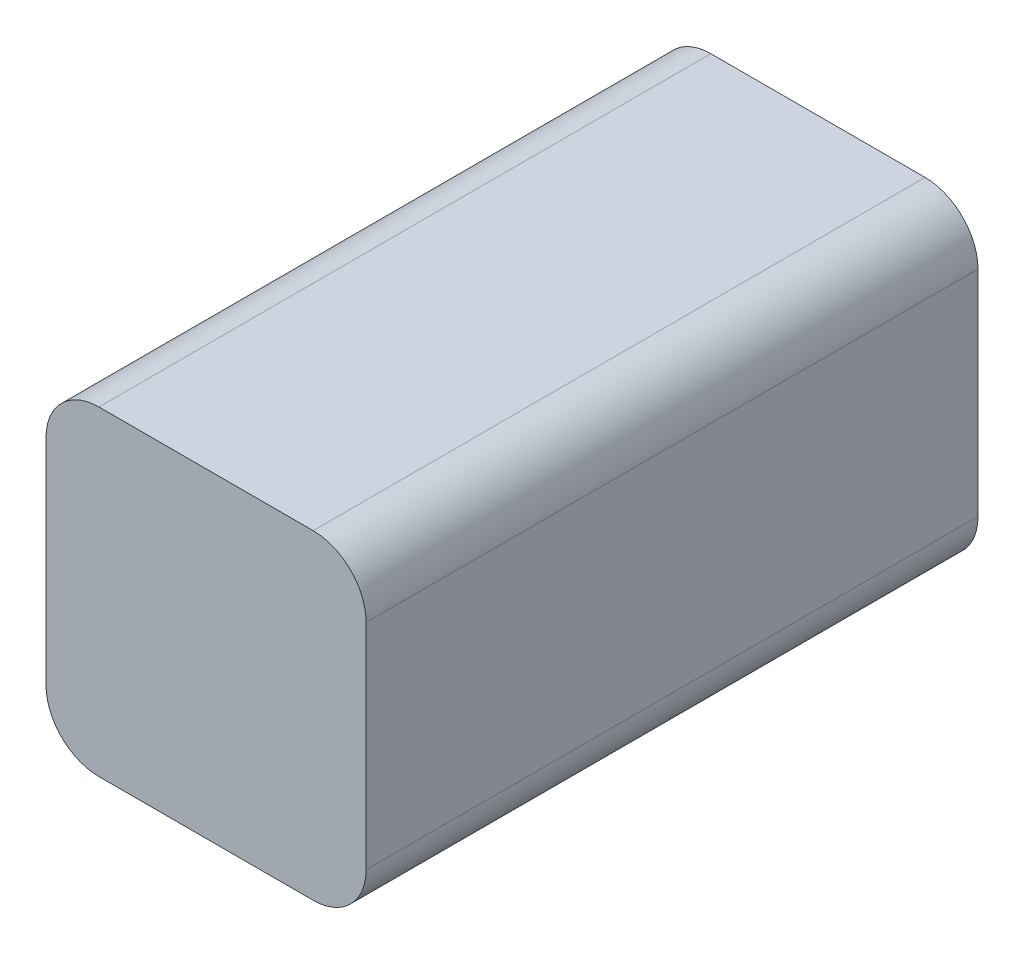
ISO-10303-21;
HEADER;
FILE_DESCRIPTION(('STEP AP214'),'2;1');
FILE_NAME('part.step','',(''),(''),'','','');
FILE_SCHEMA(('AUTOMOTIVE_DESIGN { 1 0 10303 214 1 1 1 1 }'));
ENDSEC;
DATA;
#1=APPLICATION_CONTEXT('core data for automotive mechanical design processes');
#2=APPLICATION_PROTOCOL_DEFINITION('international standard','automotive_design',2000,#1);
#3=PRODUCT_CONTEXT('',#1,'mechanical');
#4=PRODUCT('Part','Part','',(#3));
#5=PRODUCT_RELATED_PRODUCT_CATEGORY('part','',(#4));
#6=PRODUCT_DEFINITION_FORMATION('','',#4);
#7=PRODUCT_DEFINITION_CONTEXT('part definition',#1,'design');
#8=PRODUCT_DEFINITION('design','',#6,#7);
#9=PRODUCT_DEFINITION_SHAPE('','',#8);
#10=(LENGTH_UNIT() NAMED_UNIT(*) SI_UNIT(.MILLI.,.METRE.));
#11=(NAMED_UNIT(*) PLANE_ANGLE_UNIT() SI_UNIT($,.RADIAN.));
#12=(NAMED_UNIT(*) SI_UNIT($,.STERADIAN.) SOLID_ANGLE_UNIT());
#13=UNCERTAINTY_MEASURE_WITH_UNIT(LENGTH_MEASURE(1.E-05),#10,'distance_accuracy_value','');
#14=(GEOMETRIC_REPRESENTATION_CONTEXT(3) GLOBAL_UNCERTAINTY_ASSIGNED_CONTEXT((#13)) GLOBAL_UNIT_ASSIGNED_CONTEXT((#10,
#11,#12)) REPRESENTATION_CONTEXT('',''));
#15=CARTESIAN_POINT('',(0.,0.,0.));
#16=DIRECTION('',(0.,0.,1.));
#17=DIRECTION('',(1.,0.,0.));
#18=AXIS2_PLACEMENT_3D('',#15,#16,#17);
#19=CARTESIAN_POINT('',(15.2000000000698,15.2000000000203,-15.));
#20=DIRECTION('',(1.,-2.57698983679999E-12,0.));
#21=DIRECTION('',(2.57698983679999E-12,1.,0.));
#22=AXIS2_PLACEMENT_3D('',#19,#20,#21);
#23=PLANE('',#22);
#24=DIRECTION('',(-2.57698983679999E-12,-1.,0.));
#25=VECTOR('',#24,1.);
#26=CARTESIAN_POINT('',(15.2000000000698,15.2000000000203,-15.));
#27=LINE('',#26,#25);
#28=CARTESIAN_POINT('',(15.2000000000616,12.0250000000204,-15.));
#29=VERTEX_POINT('',#28);
#30=CARTESIAN_POINT('',(15.2000000000285,-0.825000000020372,-15.));
#31=VERTEX_POINT('',#30);
#32=EDGE_CURVE('E182',#29,#31,#27,.T.);
#33=ORIENTED_EDGE('',*,*,#32,.F.);
#34=DIRECTION('',(0.,0.,1.));
#35=VECTOR('',#34,1.);
#36=CARTESIAN_POINT('',(15.2000000000616,12.0250000000204,21.7));
#37=LINE('',#36,#35);
#38=CARTESIAN_POINT('',(15.2000000000616,12.0250000000204,21.7));
#39=VERTEX_POINT('',#38);
#40=EDGE_CURVE('E194',#29,#39,#37,.T.);
#41=ORIENTED_EDGE('',*,*,#40,.T.);
#42=DIRECTION('',(-2.57698983679999E-12,-1.,0.));
#43=VECTOR('',#42,1.);
#44=CARTESIAN_POINT('',(15.2000000000698,15.2000000000203,21.7));
#45=LINE('',#44,#43);
#46=CARTESIAN_POINT('',(15.2000000000285,-0.825000000020372,21.7));
#47=VERTEX_POINT('',#46);
#48=EDGE_CURVE('E177',#39,#47,#45,.T.);
#49=ORIENTED_EDGE('',*,*,#48,.T.);
#50=DIRECTION('',(0.,0.,1.));
#51=VECTOR('',#50,1.);
#52=CARTESIAN_POINT('',(15.2000000000285,-0.825000000020372,-15.));
#53=LINE('',#52,#51);
#54=EDGE_CURVE('E185',#47,#31,#53,.F.);
#55=ORIENTED_EDGE('',*,*,#54,.T.);
#56=EDGE_LOOP('',(#33,#41,#49,#55));
#57=FACE_BOUND('',#56,.T.);
#58=ADVANCED_FACE('F37',(#57),#23,.T.);
#59=CARTESIAN_POINT('',(-3.99999999992142,15.2000000000698,-15.));
#60=DIRECTION('',(0.,0.,-1.));
#61=DIRECTION('',(-1.,0.,0.));
#62=AXIS2_PLACEMENT_3D('',#59,#60,#61);
#63=PLANE('',#62);
#64=DIRECTION('',(0.,-1.,0.));
#65=VECTOR('',#64,1.);
#66=CARTESIAN_POINT('',(11.5,11.5,-15.));
#67=LINE('',#66,#65);
#68=CARTESIAN_POINT('',(11.5,11.5,-15.));
#69=VERTEX_POINT('',#68);
#70=CARTESIAN_POINT('',(11.5,-0.3,-15.));
#71=VERTEX_POINT('',#70);
#72=EDGE_CURVE('E134',#69,#71,#67,.T.);
#73=ORIENTED_EDGE('',*,*,#72,.F.);
#74=DIRECTION('',(1.,0.,0.));
#75=VECTOR('',#74,1.);
#76=CARTESIAN_POINT('',(-0.3,11.5,-15.));
#77=LINE('',#76,#75);
#78=CARTESIAN_POINT('',(-0.3,11.5,-15.));
#79=VERTEX_POINT('',#78);
#80=EDGE_CURVE('E151',#79,#69,#77,.T.);
#81=ORIENTED_EDGE('',*,*,#80,.F.);
#82=DIRECTION('',(0.,1.,0.));
#83=VECTOR('',#82,1.);
#84=CARTESIAN_POINT('',(-0.3,-0.3,-15.));
#85=LINE('',#84,#83);
#86=CARTESIAN_POINT('',(-0.3,-0.3,-15.));
#87=VERTEX_POINT('',#86);
#88=EDGE_CURVE('E154',#87,#79,#85,.T.);
#89=ORIENTED_EDGE('',*,*,#88,.F.);
#90=DIRECTION('',(-1.,0.,0.));
#91=VECTOR('',#90,1.);
#92=CARTESIAN_POINT('',(11.5,-0.3,-15.));
#93=LINE('',#92,#91);
#94=EDGE_CURVE('E160',#71,#87,#93,.T.);
#95=ORIENTED_EDGE('',*,*,#94,.F.);
#96=EDGE_LOOP('',(#73,#81,#89,#95));
#97=FACE_BOUND('',#96,.T.);
#98=DIRECTION('',(1.,-2.57696786363714E-12,0.));
#99=VECTOR('',#98,1.);
#100=CARTESIAN_POINT('',(-3.99999999992142,15.2000000000698,-15.));
#101=LINE('',#100,#99);
#102=CARTESIAN_POINT('',(-0.824999999921419,15.2000000000616,-15.));
#103=VERTEX_POINT('',#102);
#104=CARTESIAN_POINT('',(12.0250000000698,15.2000000000285,-15.));
#105=VERTEX_POINT('',#104);
#106=EDGE_CURVE('E173',#103,#105,#101,.T.);
#107=ORIENTED_EDGE('',*,*,#106,.T.);
#108=CARTESIAN_POINT('',(12.0250000000616,12.0250000000285,-15.));
#109=DIRECTION('',(0.,0.,-1.));
#110=DIRECTION('',(-1.,0.,0.));
#111=AXIS2_PLACEMENT_3D('',#108,#109,#110);
#112=CIRCLE('',#111,3.175);
#113=EDGE_CURVE('E213',#105,#29,#112,.T.);
#114=ORIENTED_EDGE('',*,*,#113,.T.);
#115=ORIENTED_EDGE('',*,*,#32,.T.);
#116=CARTESIAN_POINT('',(12.0250000000285,-0.825000000012191,-15.));
#117=DIRECTION('',(0.,0.,-1.));
#118=DIRECTION('',(-1.,0.,0.));
#119=AXIS2_PLACEMENT_3D('',#116,#117,#118);
#120=CIRCLE('',#119,3.175);
#121=CARTESIAN_POINT('',(12.0250000000204,-4.00000000001219,-15.));
#122=VERTEX_POINT('',#121);
#123=EDGE_CURVE('E211',#31,#122,#120,.T.);
#124=ORIENTED_EDGE('',*,*,#123,.T.);
#125=DIRECTION('',(1.,-2.57696786363714E-12,0.));
#126=VECTOR('',#125,1.);
#127=CARTESIAN_POINT('',(-3.9999999999709,-3.99999999997089,-15.));
#128=LINE('',#127,#126);
#129=CARTESIAN_POINT('',(-0.824999999970898,-3.99999999997908,-15.));
#130=VERTEX_POINT('',#129);
#131=EDGE_CURVE('E174',#130,#122,#128,.T.);
#132=ORIENTED_EDGE('',*,*,#131,.F.);
#133=CARTESIAN_POINT('',(-0.824999999962716,-0.824999999979077,-15.));
#134=DIRECTION('',(0.,0.,-1.));
#135=DIRECTION('',(-1.,0.,0.));
#136=AXIS2_PLACEMENT_3D('',#133,#134,#135);
#137=CIRCLE('',#136,3.175);
#138=CARTESIAN_POINT('',(-3.99999999996271,-0.824999999970894,-15.));
#139=VERTEX_POINT('',#138);
#140=EDGE_CURVE('E52',#130,#139,#137,.T.);
#141=ORIENTED_EDGE('',*,*,#140,.T.);
#142=DIRECTION('',(-2.57698983679999E-12,-1.,0.));
#143=VECTOR('',#142,1.);
#144=CARTESIAN_POINT('',(-3.99999999992142,15.2000000000698,-15.));
#145=LINE('',#144,#143);
#146=CARTESIAN_POINT('',(-3.9999999999296,12.0250000000698,-15.));
#147=VERTEX_POINT('',#146);
#148=EDGE_CURVE('E186',#147,#139,#145,.T.);
#149=ORIENTED_EDGE('',*,*,#148,.F.);
#150=CARTESIAN_POINT('',(-0.824999999929601,12.0250000000616,-15.));
#151=DIRECTION('',(0.,0.,-1.));
#152=DIRECTION('',(-1.,0.,0.));
#153=AXIS2_PLACEMENT_3D('',#150,#151,#152);
#154=CIRCLE('',#153,3.175);
#155=EDGE_CURVE('E60',#147,#103,#154,.T.);
#156=ORIENTED_EDGE('',*,*,#155,.T.);
#157=EDGE_LOOP('',(#107,#114,#115,#124,#132,#141,#149,#156));
#158=FACE_BOUND('',#157,.T.);
#159=ADVANCED_FACE('F235',(#97,#158),#63,.T.);
#160=CARTESIAN_POINT('',(-3.99999999992142,15.2000000000698,21.7));
#161=DIRECTION('',(-1.,2.57698983679999E-12,0.));
#162=DIRECTION('',(-2.57698983679999E-12,-1.,0.));
#163=AXIS2_PLACEMENT_3D('',#160,#161,#162);
#164=PLANE('',#163);
#165=DIRECTION('',(-2.57698983679999E-12,-1.,0.));
#166=VECTOR('',#165,1.);
#167=CARTESIAN_POINT('',(-3.99999999992142,15.2000000000698,21.7));
#168=LINE('',#167,#166);
#169=CARTESIAN_POINT('',(-3.9999999999296,12.0250000000698,21.7));
#170=VERTEX_POINT('',#169);
#171=CARTESIAN_POINT('',(-3.99999999996272,-0.824999999970894,21.7));
#172=VERTEX_POINT('',#171);
#173=EDGE_CURVE('E188',#170,#172,#168,.T.);
#174=ORIENTED_EDGE('',*,*,#173,.F.);
#175=DIRECTION('',(0.,0.,-1.));
#176=VECTOR('',#175,1.);
#177=CARTESIAN_POINT('',(-3.9999999999296,12.0250000000698,-15.));
#178=LINE('',#177,#176);
#179=EDGE_CURVE('E11',#170,#147,#178,.T.);
#180=ORIENTED_EDGE('',*,*,#179,.T.);
#181=ORIENTED_EDGE('',*,*,#148,.T.);
#182=DIRECTION('',(0.,0.,-1.));
#183=VECTOR('',#182,1.);
#184=CARTESIAN_POINT('',(-3.99999999996272,-0.824999999970894,21.7));
#185=LINE('',#184,#183);
#186=EDGE_CURVE('E45',#139,#172,#185,.F.);
#187=ORIENTED_EDGE('',*,*,#186,.T.);
#188=EDGE_LOOP('',(#174,#180,#181,#187));
#189=FACE_BOUND('',#188,.T.);
#190=ADVANCED_FACE('F223',(#189),#164,.T.);
#191=CARTESIAN_POINT('',(15.2000000000698,15.2000000000203,21.7));
#192=DIRECTION('',(0.,0.,1.));
#193=DIRECTION('',(1.,0.,0.));
#194=AXIS2_PLACEMENT_3D('',#191,#192,#193);
#195=PLANE('',#194);
#196=ORIENTED_EDGE('',*,*,#48,.F.);
#197=CARTESIAN_POINT('',(12.0250000000616,12.0250000000285,21.7));
#198=DIRECTION('',(0.,0.,1.));
#199=DIRECTION('',(1.,0.,0.));
#200=AXIS2_PLACEMENT_3D('',#197,#198,#199);
#201=CIRCLE('',#200,3.175);
#202=CARTESIAN_POINT('',(12.0250000000698,15.2000000000285,21.7));
#203=VERTEX_POINT('',#202);
#204=EDGE_CURVE('E203',#39,#203,#201,.T.);
#205=ORIENTED_EDGE('',*,*,#204,.T.);
#206=DIRECTION('',(-1.,2.57696786363714E-12,0.));
#207=VECTOR('',#206,1.);
#208=CARTESIAN_POINT('',(15.2000000000698,15.2000000000203,21.7));
#209=LINE('',#208,#207);
#210=CARTESIAN_POINT('',(-0.82499999992142,15.2000000000616,21.7));
#211=VERTEX_POINT('',#210);
#212=EDGE_CURVE('E170',#203,#211,#209,.T.);
#213=ORIENTED_EDGE('',*,*,#212,.T.);
#214=CARTESIAN_POINT('',(-0.824999999929603,12.0250000000616,21.7));
#215=DIRECTION('',(0.,0.,1.));
#216=DIRECTION('',(1.,0.,0.));
#217=AXIS2_PLACEMENT_3D('',#214,#215,#216);
#218=CIRCLE('',#217,3.175);
#219=EDGE_CURVE('E199',#211,#170,#218,.T.);
#220=ORIENTED_EDGE('',*,*,#219,.T.);
#221=ORIENTED_EDGE('',*,*,#173,.T.);
#222=CARTESIAN_POINT('',(-0.824999999962717,-0.824999999979077,21.7));
#223=DIRECTION('',(0.,0.,1.));
#224=DIRECTION('',(1.,0.,0.));
#225=AXIS2_PLACEMENT_3D('',#222,#223,#224);
#226=CIRCLE('',#225,3.175);
#227=CARTESIAN_POINT('',(-0.824999999970898,-3.99999999997908,21.7));
#228=VERTEX_POINT('',#227);
#229=EDGE_CURVE('E197',#172,#228,#226,.T.);
#230=ORIENTED_EDGE('',*,*,#229,.T.);
#231=DIRECTION('',(-1.,2.57696786363714E-12,0.));
#232=VECTOR('',#231,1.);
#233=CARTESIAN_POINT('',(15.2000000000203,-4.00000000002037,21.7));
#234=LINE('',#233,#232);
#235=CARTESIAN_POINT('',(12.0250000000203,-4.00000000001219,21.7));
#236=VERTEX_POINT('',#235);
#237=EDGE_CURVE('E166',#236,#228,#234,.T.);
#238=ORIENTED_EDGE('',*,*,#237,.F.);
#239=CARTESIAN_POINT('',(12.0250000000285,-0.825000000012191,21.7));
#240=DIRECTION('',(0.,0.,1.));
#241=DIRECTION('',(1.,0.,0.));
#242=AXIS2_PLACEMENT_3D('',#239,#240,#241);
#243=CIRCLE('',#242,3.175);
#244=EDGE_CURVE('E201',#236,#47,#243,.T.);
#245=ORIENTED_EDGE('',*,*,#244,.T.);
#246=EDGE_LOOP('',(#196,#205,#213,#220,#221,#230,#238,#245));
#247=FACE_BOUND('',#246,.T.);
#248=ADVANCED_FACE('F228',(#247),#195,.T.);
#249=CARTESIAN_POINT('',(3.91703334121647E-11,15.2000000000595,0.));
#250=DIRECTION('',(-2.57696786363714E-12,-1.,0.));
#251=DIRECTION('',(1.,-2.57696786363714E-12,0.));
#252=AXIS2_PLACEMENT_3D('',#249,#250,#251);
#253=PLANE('',#252);
#254=ORIENTED_EDGE('',*,*,#212,.F.);
#255=DIRECTION('',(0.,0.,1.));
#256=VECTOR('',#255,1.);
#257=CARTESIAN_POINT('',(12.0250000000698,15.2000000000285,-15.));
#258=LINE('',#257,#256);
#259=EDGE_CURVE('E207',#203,#105,#258,.F.);
#260=ORIENTED_EDGE('',*,*,#259,.T.);
#261=ORIENTED_EDGE('',*,*,#106,.F.);
#262=DIRECTION('',(0.,0.,-1.));
#263=VECTOR('',#262,1.);
#264=CARTESIAN_POINT('',(-0.824999999921421,15.2000000000616,21.7));
#265=LINE('',#264,#263);
#266=EDGE_CURVE('E205',#103,#211,#265,.F.);
#267=ORIENTED_EDGE('',*,*,#266,.T.);
#268=EDGE_LOOP('',(#254,#260,#261,#267));
#269=FACE_BOUND('',#268,.T.);
#270=ADVANCED_FACE('F249',(#269),#253,.F.);
#271=CARTESIAN_POINT('',(-1.03078714545001E-11,-3.9999999999812,0.));
#272=DIRECTION('',(-2.57696786363714E-12,-1.,0.));
#273=DIRECTION('',(1.,-2.57696786363714E-12,0.));
#274=AXIS2_PLACEMENT_3D('',#271,#272,#273);
#275=PLANE('',#274);
#276=ORIENTED_EDGE('',*,*,#131,.T.);
#277=DIRECTION('',(0.,0.,1.));
#278=VECTOR('',#277,1.);
#279=CARTESIAN_POINT('',(12.0250000000203,-4.00000000001219,0.));
#280=LINE('',#279,#278);
#281=EDGE_CURVE('E218',#122,#236,#280,.T.);
#282=ORIENTED_EDGE('',*,*,#281,.T.);
#283=ORIENTED_EDGE('',*,*,#237,.T.);
#284=DIRECTION('',(0.,0.,-1.));
#285=VECTOR('',#284,1.);
#286=CARTESIAN_POINT('',(-0.824999999970898,-3.99999999997908,0.));
#287=LINE('',#286,#285);
#288=EDGE_CURVE('E215',#228,#130,#287,.T.);
#289=ORIENTED_EDGE('',*,*,#288,.T.);
#290=EDGE_LOOP('',(#276,#282,#283,#289));
#291=FACE_BOUND('',#290,.T.);
#292=ADVANCED_FACE('F233',(#291),#275,.T.);
#293=CARTESIAN_POINT('',(11.5,11.5,19.2));
#294=DIRECTION('',(1.,0.,0.));
#295=DIRECTION('',(0.,0.,-1.));
#296=AXIS2_PLACEMENT_3D('',#293,#294,#295);
#297=PLANE('',#296);
#298=ORIENTED_EDGE('',*,*,#72,.T.);
#299=DIRECTION('',(0.,0.,-1.));
#300=VECTOR('',#299,1.);
#301=CARTESIAN_POINT('',(11.5,-0.3,19.2));
#302=LINE('',#301,#300);
#303=CARTESIAN_POINT('',(11.5,-0.3,19.2));
#304=VERTEX_POINT('',#303);
#305=EDGE_CURVE('E127',#304,#71,#302,.T.);
#306=ORIENTED_EDGE('',*,*,#305,.F.);
#307=DIRECTION('',(0.,-1.,0.));
#308=VECTOR('',#307,1.);
#309=CARTESIAN_POINT('',(11.5,11.5,19.2));
#310=LINE('',#309,#308);
#311=CARTESIAN_POINT('',(11.5,11.5,19.2));
#312=VERTEX_POINT('',#311);
#313=EDGE_CURVE('E131',#312,#304,#310,.T.);
#314=ORIENTED_EDGE('',*,*,#313,.F.);
#315=DIRECTION('',(0.,0.,-1.));
#316=VECTOR('',#315,1.);
#317=CARTESIAN_POINT('',(11.5,11.5,19.2));
#318=LINE('',#317,#316);
#319=EDGE_CURVE('E164',#312,#69,#318,.T.);
#320=ORIENTED_EDGE('',*,*,#319,.T.);
#321=EDGE_LOOP('',(#298,#306,#314,#320));
#322=FACE_BOUND('',#321,.T.);
#323=ADVANCED_FACE('F129',(#322),#297,.F.);
#324=CARTESIAN_POINT('',(-0.3,11.5,19.2));
#325=DIRECTION('',(0.,1.,0.));
#326=DIRECTION('',(0.,0.,1.));
#327=AXIS2_PLACEMENT_3D('',#324,#325,#326);
#328=PLANE('',#327);
#329=ORIENTED_EDGE('',*,*,#80,.T.);
#330=ORIENTED_EDGE('',*,*,#319,.F.);
#331=DIRECTION('',(1.,0.,0.));
#332=VECTOR('',#331,1.);
#333=CARTESIAN_POINT('',(-0.3,11.5,19.2));
#334=LINE('',#333,#332);
#335=CARTESIAN_POINT('',(-0.3,11.5,19.2));
#336=VERTEX_POINT('',#335);
#337=EDGE_CURVE('E139',#336,#312,#334,.T.);
#338=ORIENTED_EDGE('',*,*,#337,.F.);
#339=DIRECTION('',(0.,0.,-1.));
#340=VECTOR('',#339,1.);
#341=CARTESIAN_POINT('',(-0.3,11.5,19.2));
#342=LINE('',#341,#340);
#343=EDGE_CURVE('E167',#336,#79,#342,.T.);
#344=ORIENTED_EDGE('',*,*,#343,.T.);
#345=EDGE_LOOP('',(#329,#330,#338,#344));
#346=FACE_BOUND('',#345,.T.);
#347=ADVANCED_FACE('F279',(#346),#328,.F.);
#348=CARTESIAN_POINT('',(-0.3,-0.3,19.2));
#349=DIRECTION('',(-1.,0.,0.));
#350=DIRECTION('',(0.,0.,1.));
#351=AXIS2_PLACEMENT_3D('',#348,#349,#350);
#352=PLANE('',#351);
#353=ORIENTED_EDGE('',*,*,#88,.T.);
#354=ORIENTED_EDGE('',*,*,#343,.F.);
#355=DIRECTION('',(0.,1.,0.));
#356=VECTOR('',#355,1.);
#357=CARTESIAN_POINT('',(-0.3,-0.3,19.2));
#358=LINE('',#357,#356);
#359=CARTESIAN_POINT('',(-0.3,-0.3,19.2));
#360=VERTEX_POINT('',#359);
#361=EDGE_CURVE('E147',#360,#336,#358,.T.);
#362=ORIENTED_EDGE('',*,*,#361,.F.);
#363=DIRECTION('',(0.,0.,-1.));
#364=VECTOR('',#363,1.);
#365=CARTESIAN_POINT('',(-0.3,-0.3,19.2));
#366=LINE('',#365,#364);
#367=EDGE_CURVE('E138',#360,#87,#366,.T.);
#368=ORIENTED_EDGE('',*,*,#367,.T.);
#369=EDGE_LOOP('',(#353,#354,#362,#368));
#370=FACE_BOUND('',#369,.T.);
#371=ADVANCED_FACE('F276',(#370),#352,.F.);
#372=CARTESIAN_POINT('',(11.5,-0.3,19.2));
#373=DIRECTION('',(0.,-1.,0.));
#374=DIRECTION('',(0.,0.,-1.));
#375=AXIS2_PLACEMENT_3D('',#372,#373,#374);
#376=PLANE('',#375);
#377=ORIENTED_EDGE('',*,*,#94,.T.);
#378=ORIENTED_EDGE('',*,*,#367,.F.);
#379=DIRECTION('',(-1.,0.,0.));
#380=VECTOR('',#379,1.);
#381=CARTESIAN_POINT('',(11.5,-0.3,19.2));
#382=LINE('',#381,#380);
#383=EDGE_CURVE('E142',#304,#360,#382,.T.);
#384=ORIENTED_EDGE('',*,*,#383,.F.);
#385=ORIENTED_EDGE('',*,*,#305,.T.);
#386=EDGE_LOOP('',(#377,#378,#384,#385));
#387=FACE_BOUND('',#386,.T.);
#388=ADVANCED_FACE('F143',(#387),#376,.F.);
#389=CARTESIAN_POINT('',(0.,0.,19.2));
#390=DIRECTION('',(0.,0.,-1.));
#391=DIRECTION('',(-1.,0.,0.));
#392=AXIS2_PLACEMENT_3D('',#389,#390,#391);
#393=PLANE('',#392);
#394=ORIENTED_EDGE('',*,*,#313,.T.);
#395=ORIENTED_EDGE('',*,*,#383,.T.);
#396=ORIENTED_EDGE('',*,*,#361,.T.);
#397=ORIENTED_EDGE('',*,*,#337,.T.);
#398=EDGE_LOOP('',(#394,#395,#396,#397));
#399=FACE_BOUND('',#398,.T.);
#400=ADVANCED_FACE('F149',(#399),#393,.T.);
#401=CARTESIAN_POINT('',(12.0250000000616,12.0250000000285,-15.));
#402=DIRECTION('',(0.,0.,-1.));
#403=DIRECTION('',(-1.,0.,0.));
#404=AXIS2_PLACEMENT_3D('',#401,#402,#403);
#405=CYLINDRICAL_SURFACE('',#404,3.175);
#406=ORIENTED_EDGE('',*,*,#113,.F.);
#407=ORIENTED_EDGE('',*,*,#259,.F.);
#408=ORIENTED_EDGE('',*,*,#204,.F.);
#409=ORIENTED_EDGE('',*,*,#40,.F.);
#410=EDGE_LOOP('',(#406,#407,#408,#409));
#411=FACE_BOUND('',#410,.T.);
#412=ADVANCED_FACE('F245',(#411),#405,.T.);
#413=CARTESIAN_POINT('',(12.0250000000285,-0.825000000012191,0.));
#414=DIRECTION('',(0.,0.,1.));
#415=DIRECTION('',(1.,0.,0.));
#416=AXIS2_PLACEMENT_3D('',#413,#414,#415);
#417=CYLINDRICAL_SURFACE('',#416,3.175);
#418=ORIENTED_EDGE('',*,*,#123,.F.);
#419=ORIENTED_EDGE('',*,*,#54,.F.);
#420=ORIENTED_EDGE('',*,*,#244,.F.);
#421=ORIENTED_EDGE('',*,*,#281,.F.);
#422=EDGE_LOOP('',(#418,#419,#420,#421));
#423=FACE_BOUND('',#422,.T.);
#424=ADVANCED_FACE('F240',(#423),#417,.T.);
#425=CARTESIAN_POINT('',(-0.824999999929603,12.0250000000616,21.7));
#426=DIRECTION('',(0.,0.,1.));
#427=DIRECTION('',(1.,0.,0.));
#428=AXIS2_PLACEMENT_3D('',#425,#426,#427);
#429=CYLINDRICAL_SURFACE('',#428,3.175);
#430=ORIENTED_EDGE('',*,*,#219,.F.);
#431=ORIENTED_EDGE('',*,*,#266,.F.);
#432=ORIENTED_EDGE('',*,*,#155,.F.);
#433=ORIENTED_EDGE('',*,*,#179,.F.);
#434=EDGE_LOOP('',(#430,#431,#432,#433));
#435=FACE_BOUND('',#434,.T.);
#436=ADVANCED_FACE('F251',(#435),#429,.T.);
#437=CARTESIAN_POINT('',(-0.824999999962716,-0.824999999979077,0.));
#438=DIRECTION('',(0.,0.,-1.));
#439=DIRECTION('',(-1.,0.,0.));
#440=AXIS2_PLACEMENT_3D('',#437,#438,#439);
#441=CYLINDRICAL_SURFACE('',#440,3.175);
#442=ORIENTED_EDGE('',*,*,#229,.F.);
#443=ORIENTED_EDGE('',*,*,#186,.F.);
#444=ORIENTED_EDGE('',*,*,#140,.F.);
#445=ORIENTED_EDGE('',*,*,#288,.F.);
#446=EDGE_LOOP('',(#442,#443,#444,#445));
#447=FACE_BOUND('',#446,.T.);
#448=ADVANCED_FACE('F39',(#447),#441,.T.);
#449=CLOSED_SHELL('',(#58,#159,#190,#248,#270,#292,#323,#347,#371,#388,#400,#412,#424,#436,#448));
#450=MANIFOLD_SOLID_BREP('B2',#449);
#451=ADVANCED_BREP_SHAPE_REPRESENTATION('',(#18,#450),#14);
#452=SHAPE_DEFINITION_REPRESENTATION(#9,#451);
ENDSEC;
END-ISO-10303-21;
